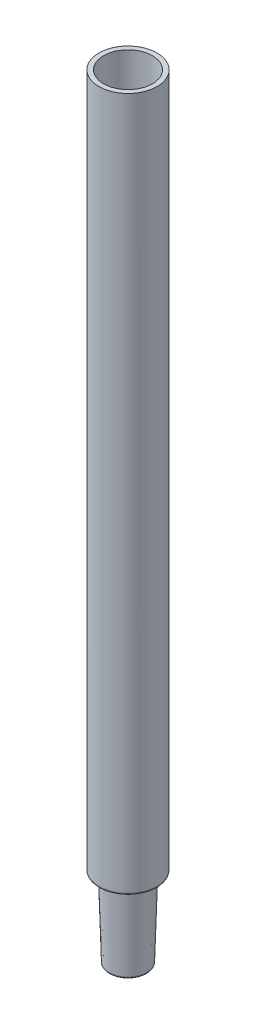
ISO-10303-21;
HEADER;
FILE_DESCRIPTION(('STEP AP214'),'2;1');
FILE_NAME('part.step','',(''),(''),'','','');
FILE_SCHEMA(('AUTOMOTIVE_DESIGN { 1 0 10303 214 1 1 1 1 }'));
ENDSEC;
DATA;
#1=APPLICATION_CONTEXT('core data for automotive mechanical design processes');
#2=APPLICATION_PROTOCOL_DEFINITION('international standard','automotive_design',2000,#1);
#3=PRODUCT_CONTEXT('',#1,'mechanical');
#4=PRODUCT('Part','Part','',(#3));
#5=PRODUCT_RELATED_PRODUCT_CATEGORY('part','',(#4));
#6=PRODUCT_DEFINITION_FORMATION('','',#4);
#7=PRODUCT_DEFINITION_CONTEXT('part definition',#1,'design');
#8=PRODUCT_DEFINITION('design','',#6,#7);
#9=PRODUCT_DEFINITION_SHAPE('','',#8);
#10=(LENGTH_UNIT() NAMED_UNIT(*) SI_UNIT(.MILLI.,.METRE.));
#11=(NAMED_UNIT(*) PLANE_ANGLE_UNIT() SI_UNIT($,.RADIAN.));
#12=(NAMED_UNIT(*) SI_UNIT($,.STERADIAN.) SOLID_ANGLE_UNIT());
#13=UNCERTAINTY_MEASURE_WITH_UNIT(LENGTH_MEASURE(1.E-05),#10,'distance_accuracy_value','');
#14=(GEOMETRIC_REPRESENTATION_CONTEXT(3) GLOBAL_UNCERTAINTY_ASSIGNED_CONTEXT((#13)) GLOBAL_UNIT_ASSIGNED_CONTEXT((#10,
#11,#12)) REPRESENTATION_CONTEXT('',''));
#15=CARTESIAN_POINT('',(0.,0.,0.));
#16=DIRECTION('',(0.,0.,1.));
#17=DIRECTION('',(1.,0.,0.));
#18=AXIS2_PLACEMENT_3D('',#15,#16,#17);
#19=CARTESIAN_POINT('',(-1.5,0.,0.));
#20=DIRECTION('',(0.,-1.,0.));
#21=DIRECTION('',(1.,0.,0.));
#22=AXIS2_PLACEMENT_3D('',#19,#20,#21);
#23=PLANE('',#22);
#24=CARTESIAN_POINT('',(0.,0.,0.));
#25=DIRECTION('',(0.,-1.,0.));
#26=DIRECTION('',(1.,0.,0.));
#27=AXIS2_PLACEMENT_3D('',#24,#25,#26);
#28=CIRCLE('',#27,1.70596883943171);
#29=CARTESIAN_POINT('',(1.70596883943171,0.,0.));
#30=VERTEX_POINT('',#29);
#31=EDGE_CURVE('E58',#30,#30,#28,.F.);
#32=ORIENTED_EDGE('',*,*,#31,.T.);
#33=EDGE_LOOP('',(#32));
#34=FACE_BOUND('',#33,.T.);
#35=CARTESIAN_POINT('',(0.,0.,0.));
#36=DIRECTION('',(0.,-1.,0.));
#37=DIRECTION('',(1.,0.,0.));
#38=AXIS2_PLACEMENT_3D('',#35,#36,#37);
#39=CIRCLE('',#38,1.80579586645065);
#40=CARTESIAN_POINT('',(1.80579586645065,0.,0.));
#41=VERTEX_POINT('',#40);
#42=EDGE_CURVE('E61',#41,#41,#39,.T.);
#43=ORIENTED_EDGE('',*,*,#42,.T.);
#44=EDGE_LOOP('',(#43));
#45=FACE_BOUND('',#44,.T.);
#46=ADVANCED_FACE('F32',(#34,#45),#23,.T.);
#47=CARTESIAN_POINT('',(0.,0.,0.));
#48=DIRECTION('',(0.,1.,0.));
#49=DIRECTION('',(-1.,0.,0.));
#50=AXIS2_PLACEMENT_3D('',#47,#48,#49);
#51=CONICAL_SURFACE('',#50,1.5,0.0294032882040052);
#52=CARTESIAN_POINT('',(0.,0.205879810320379,0.));
#53=DIRECTION('',(0.,-1.,0.));
#54=DIRECTION('',(1.,0.,0.));
#55=AXIS2_PLACEMENT_3D('',#52,#53,#54);
#56=CIRCLE('',#55,1.50605528853883);
#57=CARTESIAN_POINT('',(1.50605528853883,0.20587981032038,0.));
#58=VERTEX_POINT('',#57);
#59=EDGE_CURVE('E55',#58,#58,#56,.T.);
#60=ORIENTED_EDGE('',*,*,#59,.T.);
#61=EDGE_LOOP('',(#60));
#62=FACE_BOUND('',#61,.T.);
#63=CARTESIAN_POINT('',(0.,9.,0.));
#64=DIRECTION('',(0.,1.,0.));
#65=DIRECTION('',(-1.,0.,0.));
#66=AXIS2_PLACEMENT_3D('',#63,#64,#65);
#67=CIRCLE('',#66,1.76470588235294);
#68=CARTESIAN_POINT('',(-1.76470588235294,9.,0.));
#69=VERTEX_POINT('',#68);
#70=EDGE_CURVE('E64',#69,#69,#67,.T.);
#71=ORIENTED_EDGE('',*,*,#70,.T.);
#72=EDGE_LOOP('',(#71));
#73=FACE_BOUND('',#72,.T.);
#74=ADVANCED_FACE('F93',(#62,#73),#51,.F.);
#75=CARTESIAN_POINT('',(-2.6,9.,0.));
#76=DIRECTION('',(0.,1.,0.));
#77=DIRECTION('',(-1.,0.,0.));
#78=AXIS2_PLACEMENT_3D('',#75,#76,#77);
#79=PLANE('',#78);
#80=CARTESIAN_POINT('',(0.,9.,0.));
#81=DIRECTION('',(0.,1.,0.));
#82=DIRECTION('',(-1.,0.,0.));
#83=AXIS2_PLACEMENT_3D('',#80,#81,#82);
#84=CIRCLE('',#83,2.6);
#85=CARTESIAN_POINT('',(-2.6,9.,0.));
#86=VERTEX_POINT('',#85);
#87=EDGE_CURVE('E67',#86,#86,#84,.T.);
#88=ORIENTED_EDGE('',*,*,#87,.T.);
#89=EDGE_LOOP('',(#88));
#90=FACE_BOUND('',#89,.T.);
#91=ORIENTED_EDGE('',*,*,#70,.F.);
#92=EDGE_LOOP('',(#91));
#93=FACE_BOUND('',#92,.T.);
#94=ADVANCED_FACE('F99',(#90,#93),#79,.T.);
#95=CARTESIAN_POINT('',(0.,0.,0.));
#96=DIRECTION('',(0.,1.,0.));
#97=DIRECTION('',(-1.,0.,0.));
#98=AXIS2_PLACEMENT_3D('',#95,#96,#97);
#99=CYLINDRICAL_SURFACE('',#98,2.6);
#100=CARTESIAN_POINT('',(0.,82.5,0.));
#101=DIRECTION('',(0.,1.,0.));
#102=DIRECTION('',(-1.,0.,0.));
#103=AXIS2_PLACEMENT_3D('',#100,#101,#102);
#104=CIRCLE('',#103,2.60000000000001);
#105=CARTESIAN_POINT('',(-2.60000000000002,82.5,0.));
#106=VERTEX_POINT('',#105);
#107=EDGE_CURVE('E70',#106,#106,#104,.T.);
#108=ORIENTED_EDGE('',*,*,#107,.T.);
#109=EDGE_LOOP('',(#108));
#110=FACE_BOUND('',#109,.T.);
#111=ORIENTED_EDGE('',*,*,#87,.F.);
#112=EDGE_LOOP('',(#111));
#113=FACE_BOUND('',#112,.T.);
#114=ADVANCED_FACE('F90',(#110,#113),#99,.F.);
#115=CARTESIAN_POINT('',(-2.60000000000002,82.5,0.));
#116=DIRECTION('',(0.,1.,0.));
#117=DIRECTION('',(-1.,0.,0.));
#118=AXIS2_PLACEMENT_3D('',#115,#116,#117);
#119=PLANE('',#118);
#120=CARTESIAN_POINT('',(0.,82.5,0.));
#121=DIRECTION('',(0.,1.,0.));
#122=DIRECTION('',(-1.,0.,0.));
#123=AXIS2_PLACEMENT_3D('',#120,#121,#122);
#124=CIRCLE('',#123,3.1);
#125=CARTESIAN_POINT('',(-3.10000000000001,82.5,0.));
#126=VERTEX_POINT('',#125);
#127=EDGE_CURVE('E73',#126,#126,#124,.T.);
#128=ORIENTED_EDGE('',*,*,#127,.T.);
#129=EDGE_LOOP('',(#128));
#130=FACE_BOUND('',#129,.T.);
#131=ORIENTED_EDGE('',*,*,#107,.F.);
#132=EDGE_LOOP('',(#131));
#133=FACE_BOUND('',#132,.T.);
#134=ADVANCED_FACE('F77',(#130,#133),#119,.T.);
#135=CARTESIAN_POINT('',(0.,0.,0.));
#136=DIRECTION('',(0.,1.,0.));
#137=DIRECTION('',(-1.,0.,0.));
#138=AXIS2_PLACEMENT_3D('',#135,#136,#137);
#139=CYLINDRICAL_SURFACE('',#138,3.1);
#140=CARTESIAN_POINT('',(0.,8.7,0.));
#141=DIRECTION('',(0.,-1.,0.));
#142=DIRECTION('',(1.,0.,0.));
#143=AXIS2_PLACEMENT_3D('',#140,#141,#142);
#144=CIRCLE('',#143,3.1);
#145=CARTESIAN_POINT('',(3.1,8.7,0.));
#146=VERTEX_POINT('',#145);
#147=EDGE_CURVE('E10',#146,#146,#144,.F.);
#148=ORIENTED_EDGE('',*,*,#147,.T.);
#149=EDGE_LOOP('',(#148));
#150=FACE_BOUND('',#149,.T.);
#151=ORIENTED_EDGE('',*,*,#127,.F.);
#152=EDGE_LOOP('',(#151));
#153=FACE_BOUND('',#152,.T.);
#154=ADVANCED_FACE('F80',(#150,#153),#139,.T.);
#155=CARTESIAN_POINT('',(-2.25,8.5,0.));
#156=DIRECTION('',(0.,-1.,0.));
#157=DIRECTION('',(1.,0.,0.));
#158=AXIS2_PLACEMENT_3D('',#155,#156,#157);
#159=PLANE('',#158);
#160=CARTESIAN_POINT('',(0.,8.5,0.));
#161=DIRECTION('',(0.,-1.,0.));
#162=DIRECTION('',(1.,0.,0.));
#163=AXIS2_PLACEMENT_3D('',#160,#161,#162);
#164=CIRCLE('',#163,2.44420413354935);
#165=CARTESIAN_POINT('',(2.44420413354935,8.5,0.));
#166=VERTEX_POINT('',#165);
#167=EDGE_CURVE('E39',#166,#166,#164,.F.);
#168=ORIENTED_EDGE('',*,*,#167,.T.);
#169=EDGE_LOOP('',(#168));
#170=FACE_BOUND('',#169,.T.);
#171=CARTESIAN_POINT('',(0.,8.5,0.));
#172=DIRECTION('',(0.,-1.,0.));
#173=DIRECTION('',(1.,0.,0.));
#174=AXIS2_PLACEMENT_3D('',#171,#172,#173);
#175=CIRCLE('',#174,2.9);
#176=CARTESIAN_POINT('',(2.9,8.5,0.));
#177=VERTEX_POINT('',#176);
#178=EDGE_CURVE('E43',#177,#177,#175,.T.);
#179=ORIENTED_EDGE('',*,*,#178,.T.);
#180=EDGE_LOOP('',(#179));
#181=FACE_BOUND('',#180,.T.);
#182=ADVANCED_FACE('F82',(#170,#181),#159,.T.);
#183=CARTESIAN_POINT('',(0.,8.5,0.));
#184=DIRECTION('',(0.,1.,0.));
#185=DIRECTION('',(-1.,0.,0.));
#186=AXIS2_PLACEMENT_3D('',#183,#184,#185);
#187=CONICAL_SURFACE('',#186,2.25,0.0294032882040051);
#188=CARTESIAN_POINT('',(0.,0.194120189679611,0.));
#189=DIRECTION('',(0.,-1.,0.));
#190=DIRECTION('',(1.,0.,0.));
#191=AXIS2_PLACEMENT_3D('',#188,#189,#190);
#192=CIRCLE('',#191,2.00570941734352);
#193=CARTESIAN_POINT('',(2.00570941734352,0.194120189679612,0.));
#194=VERTEX_POINT('',#193);
#195=EDGE_CURVE('E47',#194,#194,#192,.F.);
#196=ORIENTED_EDGE('',*,*,#195,.T.);
#197=EDGE_LOOP('',(#196));
#198=FACE_BOUND('',#197,.T.);
#199=CARTESIAN_POINT('',(0.,8.30587981032038,0.));
#200=DIRECTION('',(0.,1.,0.));
#201=DIRECTION('',(-1.,0.,0.));
#202=AXIS2_PLACEMENT_3D('',#199,#200,#201);
#203=CIRCLE('',#202,2.24429058265648);
#204=CARTESIAN_POINT('',(-2.24429058265648,8.30587981032038,0.));
#205=VERTEX_POINT('',#204);
#206=EDGE_CURVE('E52',#205,#205,#203,.F.);
#207=ORIENTED_EDGE('',*,*,#206,.T.);
#208=EDGE_LOOP('',(#207));
#209=FACE_BOUND('',#208,.T.);
#210=ADVANCED_FACE('F88',(#198,#209),#187,.T.);
#211=CARTESIAN_POINT('',(0.,0.2,0.));
#212=DIRECTION('',(0.,-1.,0.));
#213=DIRECTION('',(1.,0.,0.));
#214=AXIS2_PLACEMENT_3D('',#211,#212,#213);
#215=TOROIDAL_SURFACE('',#214,1.70596883943171,0.2);
#216=ORIENTED_EDGE('',*,*,#59,.F.);
#217=EDGE_LOOP('',(#216));
#218=FACE_BOUND('',#217,.T.);
#219=ORIENTED_EDGE('',*,*,#31,.F.);
#220=EDGE_LOOP('',(#219));
#221=FACE_BOUND('',#220,.T.);
#222=ADVANCED_FACE('F105',(#218,#221),#215,.T.);
#223=CARTESIAN_POINT('',(0.,0.200000000000001,0.));
#224=DIRECTION('',(0.,-1.,0.));
#225=DIRECTION('',(1.,0.,0.));
#226=AXIS2_PLACEMENT_3D('',#223,#224,#225);
#227=TOROIDAL_SURFACE('',#226,1.80579586645065,0.2);
#228=ORIENTED_EDGE('',*,*,#42,.F.);
#229=EDGE_LOOP('',(#228));
#230=FACE_BOUND('',#229,.T.);
#231=ORIENTED_EDGE('',*,*,#195,.F.);
#232=EDGE_LOOP('',(#231));
#233=FACE_BOUND('',#232,.T.);
#234=ADVANCED_FACE('F108',(#230,#233),#227,.T.);
#235=CARTESIAN_POINT('',(0.,8.3,0.));
#236=DIRECTION('',(0.,-1.,0.));
#237=DIRECTION('',(1.,0.,0.));
#238=AXIS2_PLACEMENT_3D('',#235,#236,#237);
#239=TOROIDAL_SURFACE('',#238,2.44420413354935,0.2);
#240=ORIENTED_EDGE('',*,*,#206,.F.);
#241=EDGE_LOOP('',(#240));
#242=FACE_BOUND('',#241,.T.);
#243=ORIENTED_EDGE('',*,*,#167,.F.);
#244=EDGE_LOOP('',(#243));
#245=FACE_BOUND('',#244,.T.);
#246=ADVANCED_FACE('F111',(#242,#245),#239,.F.);
#247=CARTESIAN_POINT('',(0.,8.7,0.));
#248=DIRECTION('',(0.,-1.,0.));
#249=DIRECTION('',(1.,0.,0.));
#250=AXIS2_PLACEMENT_3D('',#247,#248,#249);
#251=TOROIDAL_SURFACE('',#250,2.9,0.2);
#252=ORIENTED_EDGE('',*,*,#178,.F.);
#253=EDGE_LOOP('',(#252));
#254=FACE_BOUND('',#253,.T.);
#255=ORIENTED_EDGE('',*,*,#147,.F.);
#256=EDGE_LOOP('',(#255));
#257=FACE_BOUND('',#256,.T.);
#258=ADVANCED_FACE('F34',(#254,#257),#251,.T.);
#259=CLOSED_SHELL('',(#46,#74,#94,#114,#134,#154,#182,#210,#222,#234,#246,#258));
#260=MANIFOLD_SOLID_BREP('B2',#259);
#261=ADVANCED_BREP_SHAPE_REPRESENTATION('',(#18,#260),#14);
#262=SHAPE_DEFINITION_REPRESENTATION(#9,#261);
ENDSEC;
END-ISO-10303-21;
